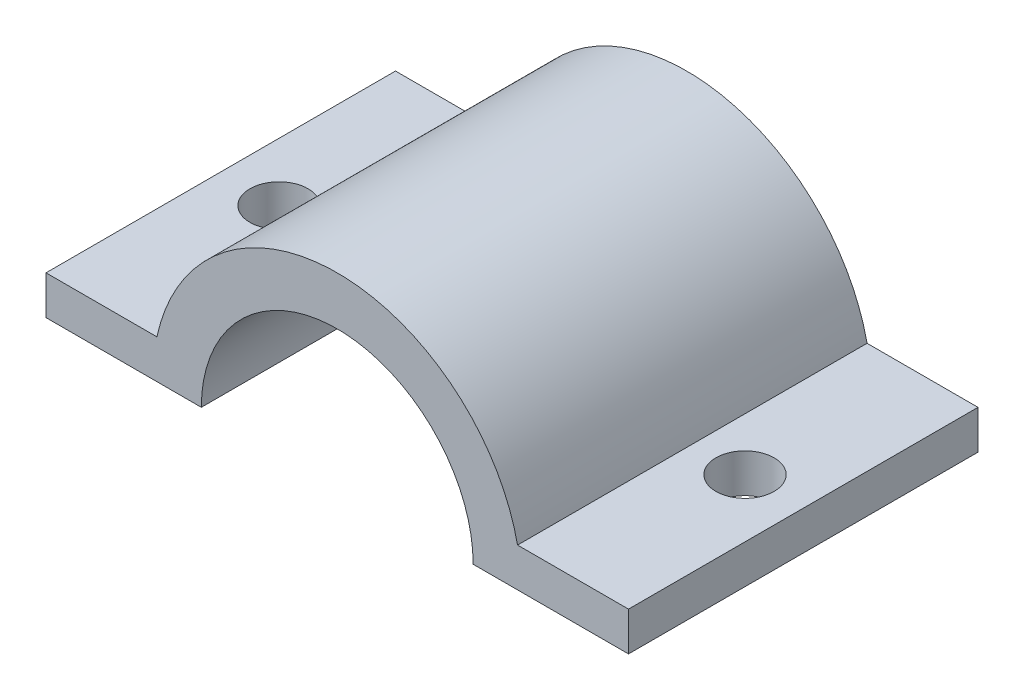
ISO-10303-21;
HEADER;
FILE_DESCRIPTION(('STEP AP214'),'2;1');
FILE_NAME('part.step','',(''),(''),'','','');
FILE_SCHEMA(('AUTOMOTIVE_DESIGN { 1 0 10303 214 1 1 1 1 }'));
ENDSEC;
DATA;
#1=APPLICATION_CONTEXT('core data for automotive mechanical design processes');
#2=APPLICATION_PROTOCOL_DEFINITION('international standard','automotive_design',2000,#1);
#3=PRODUCT_CONTEXT('',#1,'mechanical');
#4=PRODUCT('Part','Part','',(#3));
#5=PRODUCT_RELATED_PRODUCT_CATEGORY('part','',(#4));
#6=PRODUCT_DEFINITION_FORMATION('','',#4);
#7=PRODUCT_DEFINITION_CONTEXT('part definition',#1,'design');
#8=PRODUCT_DEFINITION('design','',#6,#7);
#9=PRODUCT_DEFINITION_SHAPE('','',#8);
#10=(LENGTH_UNIT() NAMED_UNIT(*) SI_UNIT(.MILLI.,.METRE.));
#11=(NAMED_UNIT(*) PLANE_ANGLE_UNIT() SI_UNIT($,.RADIAN.));
#12=(NAMED_UNIT(*) SI_UNIT($,.STERADIAN.) SOLID_ANGLE_UNIT());
#13=UNCERTAINTY_MEASURE_WITH_UNIT(LENGTH_MEASURE(1.E-05),#10,'distance_accuracy_value','');
#14=(GEOMETRIC_REPRESENTATION_CONTEXT(3) GLOBAL_UNCERTAINTY_ASSIGNED_CONTEXT((#13)) GLOBAL_UNIT_ASSIGNED_CONTEXT((#10,
#11,#12)) REPRESENTATION_CONTEXT('',''));
#15=CARTESIAN_POINT('',(0.,0.,0.));
#16=DIRECTION('',(0.,0.,1.));
#17=DIRECTION('',(1.,0.,0.));
#18=AXIS2_PLACEMENT_3D('',#15,#16,#17);
#19=CARTESIAN_POINT('',(-14.2,0.,18.));
#20=DIRECTION('',(1.,0.,0.));
#21=DIRECTION('',(0.,0.,-1.));
#22=AXIS2_PLACEMENT_3D('',#19,#20,#21);
#23=PLANE('',#22);
#24=DIRECTION('',(0.,-1.,0.));
#25=VECTOR('',#24,1.);
#26=CARTESIAN_POINT('',(-14.2,0.,0.));
#27=LINE('',#26,#25);
#28=CARTESIAN_POINT('',(-14.2,2.,0.));
#29=VERTEX_POINT('',#28);
#30=CARTESIAN_POINT('',(-14.2,0.,0.));
#31=VERTEX_POINT('',#30);
#32=EDGE_CURVE('E133',#29,#31,#27,.T.);
#33=ORIENTED_EDGE('',*,*,#32,.T.);
#34=DIRECTION('',(0.,0.,-1.));
#35=VECTOR('',#34,1.);
#36=CARTESIAN_POINT('',(-14.2,0.,18.));
#37=LINE('',#36,#35);
#38=CARTESIAN_POINT('',(-14.2,0.,18.));
#39=VERTEX_POINT('',#38);
#40=EDGE_CURVE('E11',#39,#31,#37,.T.);
#41=ORIENTED_EDGE('',*,*,#40,.F.);
#42=DIRECTION('',(0.,-1.,0.));
#43=VECTOR('',#42,1.);
#44=CARTESIAN_POINT('',(-14.2,0.,18.));
#45=LINE('',#44,#43);
#46=CARTESIAN_POINT('',(-14.2,2.,18.));
#47=VERTEX_POINT('',#46);
#48=EDGE_CURVE('E148',#47,#39,#45,.T.);
#49=ORIENTED_EDGE('',*,*,#48,.F.);
#50=DIRECTION('',(0.,0.,-1.));
#51=VECTOR('',#50,1.);
#52=CARTESIAN_POINT('',(-14.2,2.,18.));
#53=LINE('',#52,#51);
#54=EDGE_CURVE('E129',#47,#29,#53,.T.);
#55=ORIENTED_EDGE('',*,*,#54,.T.);
#56=EDGE_LOOP('',(#33,#41,#49,#55));
#57=FACE_BOUND('',#56,.T.);
#58=ADVANCED_FACE('F37',(#57),#23,.F.);
#59=CARTESIAN_POINT('',(-14.2,0.,18.));
#60=DIRECTION('',(0.,1.,0.));
#61=DIRECTION('',(0.,0.,1.));
#62=AXIS2_PLACEMENT_3D('',#59,#60,#61);
#63=PLANE('',#62);
#64=CARTESIAN_POINT('',(-11.2,0.,9.));
#65=DIRECTION('',(0.,1.,0.));
#66=DIRECTION('',(0.,0.,1.));
#67=AXIS2_PLACEMENT_3D('',#64,#65,#66);
#68=CIRCLE('',#67,1.5);
#69=CARTESIAN_POINT('',(-11.2,0.,10.5));
#70=VERTEX_POINT('',#69);
#71=EDGE_CURVE('E186',#70,#70,#68,.T.);
#72=ORIENTED_EDGE('',*,*,#71,.T.);
#73=EDGE_LOOP('',(#72));
#74=FACE_BOUND('',#73,.T.);
#75=DIRECTION('',(1.,0.,0.));
#76=VECTOR('',#75,1.);
#77=CARTESIAN_POINT('',(-14.2,0.,0.));
#78=LINE('',#77,#76);
#79=CARTESIAN_POINT('',(-6.2,0.,0.));
#80=VERTEX_POINT('',#79);
#81=EDGE_CURVE('E136',#31,#80,#78,.T.);
#82=ORIENTED_EDGE('',*,*,#81,.T.);
#83=DIRECTION('',(0.,0.,-1.));
#84=VECTOR('',#83,1.);
#85=CARTESIAN_POINT('',(-6.2,0.,18.));
#86=LINE('',#85,#84);
#87=CARTESIAN_POINT('',(-6.2,0.,18.));
#88=VERTEX_POINT('',#87);
#89=EDGE_CURVE('E45',#88,#80,#86,.T.);
#90=ORIENTED_EDGE('',*,*,#89,.F.);
#91=DIRECTION('',(1.,0.,0.));
#92=VECTOR('',#91,1.);
#93=CARTESIAN_POINT('',(-14.2,0.,18.));
#94=LINE('',#93,#92);
#95=EDGE_CURVE('E96',#39,#88,#94,.T.);
#96=ORIENTED_EDGE('',*,*,#95,.F.);
#97=ORIENTED_EDGE('',*,*,#40,.T.);
#98=EDGE_LOOP('',(#82,#90,#96,#97));
#99=FACE_BOUND('',#98,.T.);
#100=ADVANCED_FACE('F207',(#74,#99),#63,.F.);
#101=CARTESIAN_POINT('',(0.800000000000001,0.,18.));
#102=DIRECTION('',(0.,0.,-1.));
#103=DIRECTION('',(-1.,0.,0.));
#104=AXIS2_PLACEMENT_3D('',#101,#102,#103);
#105=CYLINDRICAL_SURFACE('',#104,7.);
#106=CARTESIAN_POINT('',(0.800000000000001,0.,0.));
#107=DIRECTION('',(0.,0.,-1.));
#108=DIRECTION('',(1.,0.,0.));
#109=AXIS2_PLACEMENT_3D('',#106,#107,#108);
#110=CIRCLE('',#109,7.);
#111=CARTESIAN_POINT('',(7.8,0.,0.));
#112=VERTEX_POINT('',#111);
#113=EDGE_CURVE('E139',#80,#112,#110,.T.);
#114=ORIENTED_EDGE('',*,*,#113,.T.);
#115=DIRECTION('',(0.,0.,-1.));
#116=VECTOR('',#115,1.);
#117=CARTESIAN_POINT('',(7.8,0.,18.));
#118=LINE('',#117,#116);
#119=CARTESIAN_POINT('',(7.8,0.,18.));
#120=VERTEX_POINT('',#119);
#121=EDGE_CURVE('E155',#120,#112,#118,.T.);
#122=ORIENTED_EDGE('',*,*,#121,.F.);
#123=CARTESIAN_POINT('',(0.800000000000001,0.,18.));
#124=DIRECTION('',(0.,0.,-1.));
#125=DIRECTION('',(1.,0.,0.));
#126=AXIS2_PLACEMENT_3D('',#123,#124,#125);
#127=CIRCLE('',#126,7.);
#128=EDGE_CURVE('E163',#88,#120,#127,.T.);
#129=ORIENTED_EDGE('',*,*,#128,.F.);
#130=ORIENTED_EDGE('',*,*,#89,.T.);
#131=EDGE_LOOP('',(#114,#122,#129,#130));
#132=FACE_BOUND('',#131,.T.);
#133=ADVANCED_FACE('F161',(#132),#105,.F.);
#134=CARTESIAN_POINT('',(7.8,0.,18.));
#135=DIRECTION('',(0.,1.,0.));
#136=DIRECTION('',(0.,0.,1.));
#137=AXIS2_PLACEMENT_3D('',#134,#135,#136);
#138=PLANE('',#137);
#139=CARTESIAN_POINT('',(12.8,0.,9.));
#140=DIRECTION('',(0.,1.,0.));
#141=DIRECTION('',(0.,0.,1.));
#142=AXIS2_PLACEMENT_3D('',#139,#140,#141);
#143=CIRCLE('',#142,1.5);
#144=CARTESIAN_POINT('',(12.8,0.,10.5));
#145=VERTEX_POINT('',#144);
#146=EDGE_CURVE('E137',#145,#145,#143,.T.);
#147=ORIENTED_EDGE('',*,*,#146,.T.);
#148=EDGE_LOOP('',(#147));
#149=FACE_BOUND('',#148,.T.);
#150=DIRECTION('',(1.,0.,0.));
#151=VECTOR('',#150,1.);
#152=CARTESIAN_POINT('',(7.8,0.,0.));
#153=LINE('',#152,#151);
#154=CARTESIAN_POINT('',(15.8,0.,0.));
#155=VERTEX_POINT('',#154);
#156=EDGE_CURVE('E141',#112,#155,#153,.T.);
#157=ORIENTED_EDGE('',*,*,#156,.T.);
#158=DIRECTION('',(0.,0.,-1.));
#159=VECTOR('',#158,1.);
#160=CARTESIAN_POINT('',(15.8,0.,18.));
#161=LINE('',#160,#159);
#162=CARTESIAN_POINT('',(15.8,0.,18.));
#163=VERTEX_POINT('',#162);
#164=EDGE_CURVE('E152',#163,#155,#161,.T.);
#165=ORIENTED_EDGE('',*,*,#164,.F.);
#166=DIRECTION('',(1.,0.,0.));
#167=VECTOR('',#166,1.);
#168=CARTESIAN_POINT('',(7.8,0.,18.));
#169=LINE('',#168,#167);
#170=EDGE_CURVE('E175',#120,#163,#169,.T.);
#171=ORIENTED_EDGE('',*,*,#170,.F.);
#172=ORIENTED_EDGE('',*,*,#121,.T.);
#173=EDGE_LOOP('',(#157,#165,#171,#172));
#174=FACE_BOUND('',#173,.T.);
#175=ADVANCED_FACE('F171',(#149,#174),#138,.F.);
#176=CARTESIAN_POINT('',(15.8,0.,18.));
#177=DIRECTION('',(-1.,0.,0.));
#178=DIRECTION('',(0.,0.,1.));
#179=AXIS2_PLACEMENT_3D('',#176,#177,#178);
#180=PLANE('',#179);
#181=DIRECTION('',(0.,1.,0.));
#182=VECTOR('',#181,1.);
#183=CARTESIAN_POINT('',(15.8,0.,0.));
#184=LINE('',#183,#182);
#185=CARTESIAN_POINT('',(15.8,2.,0.));
#186=VERTEX_POINT('',#185);
#187=EDGE_CURVE('E143',#155,#186,#184,.T.);
#188=ORIENTED_EDGE('',*,*,#187,.T.);
#189=DIRECTION('',(0.,0.,-1.));
#190=VECTOR('',#189,1.);
#191=CARTESIAN_POINT('',(15.8,2.,18.));
#192=LINE('',#191,#190);
#193=CARTESIAN_POINT('',(15.8,2.,18.));
#194=VERTEX_POINT('',#193);
#195=EDGE_CURVE('E124',#194,#186,#192,.T.);
#196=ORIENTED_EDGE('',*,*,#195,.F.);
#197=DIRECTION('',(0.,1.,0.));
#198=VECTOR('',#197,1.);
#199=CARTESIAN_POINT('',(15.8,0.,18.));
#200=LINE('',#199,#198);
#201=EDGE_CURVE('E115',#163,#194,#200,.T.);
#202=ORIENTED_EDGE('',*,*,#201,.F.);
#203=ORIENTED_EDGE('',*,*,#164,.T.);
#204=EDGE_LOOP('',(#188,#196,#202,#203));
#205=FACE_BOUND('',#204,.T.);
#206=ADVANCED_FACE('F174',(#205),#180,.F.);
#207=CARTESIAN_POINT('',(10.0870878105034,2.,18.));
#208=DIRECTION('',(0.,-1.,0.));
#209=DIRECTION('',(1.,0.,0.));
#210=AXIS2_PLACEMENT_3D('',#207,#208,#209);
#211=PLANE('',#210);
#212=CARTESIAN_POINT('',(12.8,2.00000000000001,9.));
#213=DIRECTION('',(0.,1.,0.));
#214=DIRECTION('',(-1.,0.,0.));
#215=AXIS2_PLACEMENT_3D('',#212,#213,#214);
#216=CIRCLE('',#215,1.5);
#217=CARTESIAN_POINT('',(11.3,2.00000000000001,9.));
#218=VERTEX_POINT('',#217);
#219=EDGE_CURVE('E183',#218,#218,#216,.T.);
#220=ORIENTED_EDGE('',*,*,#219,.F.);
#221=EDGE_LOOP('',(#220));
#222=FACE_BOUND('',#221,.T.);
#223=DIRECTION('',(-1.,0.,0.));
#224=VECTOR('',#223,1.);
#225=CARTESIAN_POINT('',(10.0870878105034,2.,0.));
#226=LINE('',#225,#224);
#227=CARTESIAN_POINT('',(10.0870878105034,2.,0.));
#228=VERTEX_POINT('',#227);
#229=EDGE_CURVE('E123',#186,#228,#226,.T.);
#230=ORIENTED_EDGE('',*,*,#229,.T.);
#231=DIRECTION('',(0.,0.,-1.));
#232=VECTOR('',#231,1.);
#233=CARTESIAN_POINT('',(10.0870878105034,2.,18.));
#234=LINE('',#233,#232);
#235=CARTESIAN_POINT('',(10.0870878105034,2.,18.));
#236=VERTEX_POINT('',#235);
#237=EDGE_CURVE('E120',#236,#228,#234,.T.);
#238=ORIENTED_EDGE('',*,*,#237,.F.);
#239=DIRECTION('',(-1.,0.,0.));
#240=VECTOR('',#239,1.);
#241=CARTESIAN_POINT('',(10.0870878105034,2.,18.));
#242=LINE('',#241,#240);
#243=EDGE_CURVE('E109',#194,#236,#242,.T.);
#244=ORIENTED_EDGE('',*,*,#243,.F.);
#245=ORIENTED_EDGE('',*,*,#195,.T.);
#246=EDGE_LOOP('',(#230,#238,#244,#245));
#247=FACE_BOUND('',#246,.T.);
#248=ADVANCED_FACE('F121',(#222,#247),#211,.F.);
#249=CARTESIAN_POINT('',(0.800000000000001,0.,18.));
#250=DIRECTION('',(0.,0.,-1.));
#251=DIRECTION('',(-1.,0.,0.));
#252=AXIS2_PLACEMENT_3D('',#249,#250,#251);
#253=CYLINDRICAL_SURFACE('',#252,9.5);
#254=CARTESIAN_POINT('',(0.800000000000001,0.,0.));
#255=DIRECTION('',(0.,0.,1.));
#256=DIRECTION('',(1.,0.,0.));
#257=AXIS2_PLACEMENT_3D('',#254,#255,#256);
#258=CIRCLE('',#257,9.5);
#259=CARTESIAN_POINT('',(-8.48708781050335,2.00000000000001,0.));
#260=VERTEX_POINT('',#259);
#261=EDGE_CURVE('E82',#228,#260,#258,.T.);
#262=ORIENTED_EDGE('',*,*,#261,.T.);
#263=DIRECTION('',(0.,0.,-1.));
#264=VECTOR('',#263,1.);
#265=CARTESIAN_POINT('',(-8.48708781050335,2.00000000000001,18.));
#266=LINE('',#265,#264);
#267=CARTESIAN_POINT('',(-8.48708781050335,2.00000000000001,18.));
#268=VERTEX_POINT('',#267);
#269=EDGE_CURVE('E125',#268,#260,#266,.T.);
#270=ORIENTED_EDGE('',*,*,#269,.F.);
#271=CARTESIAN_POINT('',(0.800000000000001,0.,18.));
#272=DIRECTION('',(0.,0.,1.));
#273=DIRECTION('',(1.,0.,0.));
#274=AXIS2_PLACEMENT_3D('',#271,#272,#273);
#275=CIRCLE('',#274,9.5);
#276=EDGE_CURVE('E113',#236,#268,#275,.T.);
#277=ORIENTED_EDGE('',*,*,#276,.F.);
#278=ORIENTED_EDGE('',*,*,#237,.T.);
#279=EDGE_LOOP('',(#262,#270,#277,#278));
#280=FACE_BOUND('',#279,.T.);
#281=ADVANCED_FACE('F127',(#280),#253,.T.);
#282=CARTESIAN_POINT('',(-14.2,2.,18.));
#283=DIRECTION('',(0.,-1.,0.));
#284=DIRECTION('',(1.,0.,0.));
#285=AXIS2_PLACEMENT_3D('',#282,#283,#284);
#286=PLANE('',#285);
#287=CARTESIAN_POINT('',(-11.2,2.,9.));
#288=DIRECTION('',(0.,1.,0.));
#289=DIRECTION('',(-1.,0.,0.));
#290=AXIS2_PLACEMENT_3D('',#287,#288,#289);
#291=CIRCLE('',#290,1.5);
#292=CARTESIAN_POINT('',(-12.7,2.,9.));
#293=VERTEX_POINT('',#292);
#294=EDGE_CURVE('E189',#293,#293,#291,.T.);
#295=ORIENTED_EDGE('',*,*,#294,.F.);
#296=EDGE_LOOP('',(#295));
#297=FACE_BOUND('',#296,.T.);
#298=DIRECTION('',(-1.,0.,0.));
#299=VECTOR('',#298,1.);
#300=CARTESIAN_POINT('',(-14.2,2.,0.));
#301=LINE('',#300,#299);
#302=EDGE_CURVE('E88',#260,#29,#301,.T.);
#303=ORIENTED_EDGE('',*,*,#302,.T.);
#304=ORIENTED_EDGE('',*,*,#54,.F.);
#305=DIRECTION('',(-1.,0.,0.));
#306=VECTOR('',#305,1.);
#307=CARTESIAN_POINT('',(-14.2,2.,18.));
#308=LINE('',#307,#306);
#309=EDGE_CURVE('E53',#268,#47,#308,.T.);
#310=ORIENTED_EDGE('',*,*,#309,.F.);
#311=ORIENTED_EDGE('',*,*,#269,.T.);
#312=EDGE_LOOP('',(#303,#304,#310,#311));
#313=FACE_BOUND('',#312,.T.);
#314=ADVANCED_FACE('F196',(#297,#313),#286,.F.);
#315=CARTESIAN_POINT('',(0.800000000000001,0.,18.));
#316=DIRECTION('',(0.,0.,1.));
#317=DIRECTION('',(1.,0.,0.));
#318=AXIS2_PLACEMENT_3D('',#315,#316,#317);
#319=PLANE('',#318);
#320=ORIENTED_EDGE('',*,*,#48,.T.);
#321=ORIENTED_EDGE('',*,*,#95,.T.);
#322=ORIENTED_EDGE('',*,*,#128,.T.);
#323=ORIENTED_EDGE('',*,*,#170,.T.);
#324=ORIENTED_EDGE('',*,*,#201,.T.);
#325=ORIENTED_EDGE('',*,*,#243,.T.);
#326=ORIENTED_EDGE('',*,*,#276,.T.);
#327=ORIENTED_EDGE('',*,*,#309,.T.);
#328=EDGE_LOOP('',(#320,#321,#322,#323,#324,#325,#326,#327));
#329=FACE_BOUND('',#328,.T.);
#330=ADVANCED_FACE('F111',(#329),#319,.T.);
#331=CARTESIAN_POINT('',(0.800000000000001,0.,0.));
#332=DIRECTION('',(0.,0.,1.));
#333=DIRECTION('',(1.,0.,0.));
#334=AXIS2_PLACEMENT_3D('',#331,#332,#333);
#335=PLANE('',#334);
#336=ORIENTED_EDGE('',*,*,#32,.F.);
#337=ORIENTED_EDGE('',*,*,#302,.F.);
#338=ORIENTED_EDGE('',*,*,#261,.F.);
#339=ORIENTED_EDGE('',*,*,#229,.F.);
#340=ORIENTED_EDGE('',*,*,#187,.F.);
#341=ORIENTED_EDGE('',*,*,#156,.F.);
#342=ORIENTED_EDGE('',*,*,#113,.F.);
#343=ORIENTED_EDGE('',*,*,#81,.F.);
#344=EDGE_LOOP('',(#336,#337,#338,#339,#340,#341,#342,#343));
#345=FACE_BOUND('',#344,.T.);
#346=ADVANCED_FACE('F167',(#345),#335,.F.);
#347=CARTESIAN_POINT('',(12.8,-15.,9.));
#348=DIRECTION('',(0.,1.,0.));
#349=DIRECTION('',(-1.,0.,0.));
#350=AXIS2_PLACEMENT_3D('',#347,#348,#349);
#351=CYLINDRICAL_SURFACE('',#350,1.5);
#352=ORIENTED_EDGE('',*,*,#219,.T.);
#353=EDGE_LOOP('',(#352));
#354=FACE_BOUND('',#353,.T.);
#355=ORIENTED_EDGE('',*,*,#146,.F.);
#356=EDGE_LOOP('',(#355));
#357=FACE_BOUND('',#356,.T.);
#358=ADVANCED_FACE('F231',(#354,#357),#351,.F.);
#359=CARTESIAN_POINT('',(-11.2,-15.,9.));
#360=DIRECTION('',(0.,1.,0.));
#361=DIRECTION('',(-1.,0.,0.));
#362=AXIS2_PLACEMENT_3D('',#359,#360,#361);
#363=CYLINDRICAL_SURFACE('',#362,1.5);
#364=ORIENTED_EDGE('',*,*,#294,.T.);
#365=EDGE_LOOP('',(#364));
#366=FACE_BOUND('',#365,.T.);
#367=ORIENTED_EDGE('',*,*,#71,.F.);
#368=EDGE_LOOP('',(#367));
#369=FACE_BOUND('',#368,.T.);
#370=ADVANCED_FACE('F193',(#366,#369),#363,.F.);
#371=CLOSED_SHELL('',(#58,#100,#133,#175,#206,#248,#281,#314,#330,#346,#358,#370));
#372=MANIFOLD_SOLID_BREP('B2',#371);
#373=ADVANCED_BREP_SHAPE_REPRESENTATION('',(#18,#372),#14);
#374=SHAPE_DEFINITION_REPRESENTATION(#9,#373);
ENDSEC;
END-ISO-10303-21;
